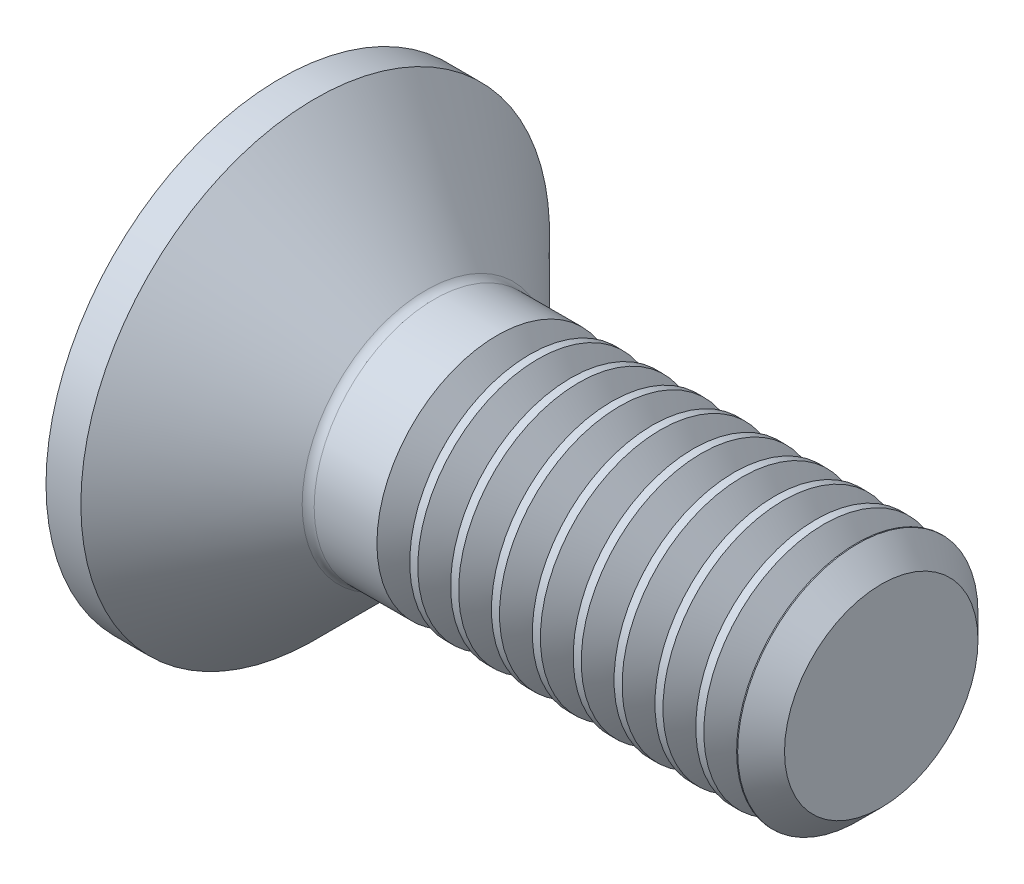
ISO-10303-21;
HEADER;
FILE_DESCRIPTION(('STEP AP214'),'2;1');
FILE_NAME('part.step','',(''),(''),'','','');
FILE_SCHEMA(('AUTOMOTIVE_DESIGN { 1 0 10303 214 1 1 1 1 }'));
ENDSEC;
DATA;
#1=APPLICATION_CONTEXT('core data for automotive mechanical design processes');
#2=APPLICATION_PROTOCOL_DEFINITION('international standard','automotive_design',2000,#1);
#3=PRODUCT_CONTEXT('',#1,'mechanical');
#4=PRODUCT('Part','Part','',(#3));
#5=PRODUCT_RELATED_PRODUCT_CATEGORY('part','',(#4));
#6=PRODUCT_DEFINITION_FORMATION('','',#4);
#7=PRODUCT_DEFINITION_CONTEXT('part definition',#1,'design');
#8=PRODUCT_DEFINITION('design','',#6,#7);
#9=PRODUCT_DEFINITION_SHAPE('','',#8);
#10=(LENGTH_UNIT() NAMED_UNIT(*) SI_UNIT(.MILLI.,.METRE.));
#11=(NAMED_UNIT(*) PLANE_ANGLE_UNIT() SI_UNIT($,.RADIAN.));
#12=(NAMED_UNIT(*) SI_UNIT($,.STERADIAN.) SOLID_ANGLE_UNIT());
#13=UNCERTAINTY_MEASURE_WITH_UNIT(LENGTH_MEASURE(1.E-05),#10,'distance_accuracy_value','');
#14=(GEOMETRIC_REPRESENTATION_CONTEXT(3) GLOBAL_UNCERTAINTY_ASSIGNED_CONTEXT((#13)) GLOBAL_UNIT_ASSIGNED_CONTEXT((#10,
#11,#12)) REPRESENTATION_CONTEXT('',''));
#15=CARTESIAN_POINT('',(0.,0.,0.));
#16=DIRECTION('',(0.,0.,1.));
#17=DIRECTION('',(1.,0.,0.));
#18=AXIS2_PLACEMENT_3D('',#15,#16,#17);
#19=CARTESIAN_POINT('',(6.77236045021345E-12,-4.44089209850063E-13,-4.44089209850063E-13));
#20=DIRECTION('',(-1.,0.,0.));
#21=DIRECTION('',(0.,0.,1.00000000000005));
#22=AXIS2_PLACEMENT_3D('',#19,#20,#21);
#23=PLANE('',#22);
#24=CARTESIAN_POINT('',(6.77236045021345E-12,-4.44089209850063E-13,-4.44089209850063E-13));
#25=DIRECTION('',(-1.,0.,0.));
#26=DIRECTION('',(0.,0.,1.00000000000005));
#27=AXIS2_PLACEMENT_3D('',#24,#25,#26);
#28=CIRCLE('',#27,3.9);
#29=CARTESIAN_POINT('',(6.76196876270296E-12,-3.84986487134142E-13,3.89999999999975));
#30=VERTEX_POINT('',#29);
#31=EDGE_CURVE('E178',#30,#30,#28,.T.);
#32=ORIENTED_EDGE('',*,*,#31,.T.);
#33=EDGE_LOOP('',(#32));
#34=FACE_BOUND('',#33,.T.);
#35=DIRECTION('',(0.,-0.500000000000031,-0.866025403784485));
#36=VECTOR('',#35,1.);
#37=CARTESIAN_POINT('',(6.99440505513849E-12,-0.721687836487961,1.24999999999997));
#38=LINE('',#37,#36);
#39=CARTESIAN_POINT('',(6.99440505513849E-12,-0.721687836487961,1.24999999999997));
#40=VERTEX_POINT('',#39);
#41=CARTESIAN_POINT('',(2.33146835171283E-12,-1.44337567297037,-6.66133814775094E-13));
#42=VERTEX_POINT('',#41);
#43=EDGE_CURVE('E144',#40,#42,#38,.T.);
#44=ORIENTED_EDGE('',*,*,#43,.T.);
#45=DIRECTION('',(0.,0.500000000000004,-0.866025403784473));
#46=VECTOR('',#45,1.);
#47=CARTESIAN_POINT('',(2.33146835171283E-12,-1.44337567297037,-6.66133814775094E-13));
#48=LINE('',#47,#46);
#49=CARTESIAN_POINT('',(2.55351295663786E-12,-0.72168783648463,-1.25000000000197));
#50=VERTEX_POINT('',#49);
#51=EDGE_CURVE('E57',#42,#50,#48,.T.);
#52=ORIENTED_EDGE('',*,*,#51,.T.);
#53=DIRECTION('',(0.,1.00000000000003,0.));
#54=VECTOR('',#53,1.);
#55=CARTESIAN_POINT('',(2.55351295663786E-12,-0.72168783648463,-1.25000000000197));
#56=LINE('',#55,#54);
#57=CARTESIAN_POINT('',(2.77555756156289E-12,0.721687836489071,-1.24999999999909));
#58=VERTEX_POINT('',#57);
#59=EDGE_CURVE('E160',#50,#58,#56,.T.);
#60=ORIENTED_EDGE('',*,*,#59,.T.);
#61=DIRECTION('',(0.,0.500000000000031,0.866025403784486));
#62=VECTOR('',#61,1.);
#63=CARTESIAN_POINT('',(2.77555756156289E-12,0.721687836489071,-1.24999999999909));
#64=LINE('',#63,#62);
#65=CARTESIAN_POINT('',(2.99760216648792E-12,1.44337567297481,0.));
#66=VERTEX_POINT('',#65);
#67=EDGE_CURVE('E691',#58,#66,#64,.T.);
#68=ORIENTED_EDGE('',*,*,#67,.T.);
#69=DIRECTION('',(0.,-0.500000000000002,0.866025403784472));
#70=VECTOR('',#69,1.);
#71=CARTESIAN_POINT('',(2.99760216648792E-12,1.44337567297481,0.));
#72=LINE('',#71,#70);
#73=CARTESIAN_POINT('',(3.66373598126302E-12,0.721687836487961,1.24999999999864));
#74=VERTEX_POINT('',#73);
#75=EDGE_CURVE('E695',#66,#74,#72,.T.);
#76=ORIENTED_EDGE('',*,*,#75,.T.);
#77=DIRECTION('',(0.,-1.00000000000003,0.));
#78=VECTOR('',#77,1.);
#79=CARTESIAN_POINT('',(3.66373598126302E-12,0.721687836487961,1.24999999999864));
#80=LINE('',#79,#78);
#81=EDGE_CURVE('E699',#74,#40,#80,.T.);
#82=ORIENTED_EDGE('',*,*,#81,.T.);
#83=EDGE_LOOP('',(#44,#52,#60,#68,#76,#82));
#84=FACE_BOUND('',#83,.T.);
#85=ADVANCED_FACE('F38',(#34,#84),#23,.T.);
#86=CARTESIAN_POINT('',(6.77236045021345E-12,-4.44089209850063E-13,-4.44089209850063E-13));
#87=DIRECTION('',(-1.,0.,0.));
#88=DIRECTION('',(0.,0.,1.00000000000005));
#89=AXIS2_PLACEMENT_3D('',#86,#87,#88);
#90=CYLINDRICAL_SURFACE('',#89,2.);
#91=CARTESIAN_POINT('',(3.60692006010466,2.22044604925031E-13,4.44089209850063E-13));
#92=DIRECTION('',(-1.,0.,0.));
#93=DIRECTION('',(0.,-1.00000000000003,0.));
#94=AXIS2_PLACEMENT_3D('',#91,#92,#93);
#95=CIRCLE('',#94,2.);
#96=CARTESIAN_POINT('',(3.60692006010465,-1.99999999999984,4.17998968771371E-13));
#97=VERTEX_POINT('',#96);
#98=EDGE_CURVE('E661',#97,#97,#95,.T.);
#99=ORIENTED_EDGE('',*,*,#98,.T.);
#100=EDGE_LOOP('',(#99));
#101=FACE_BOUND('',#100,.T.);
#102=CARTESIAN_POINT('',(2.56284271248142,2.44249065417534E-12,2.22044604925031E-13));
#103=DIRECTION('',(-1.,0.,0.));
#104=DIRECTION('',(0.,0.,1.00000000000005));
#105=AXIS2_PLACEMENT_3D('',#102,#103,#104);
#106=CIRCLE('',#105,2.);
#107=CARTESIAN_POINT('',(2.56284271248141,2.47279974274761E-12,2.00000000000032));
#108=VERTEX_POINT('',#107);
#109=EDGE_CURVE('E11',#108,#108,#106,.F.);
#110=ORIENTED_EDGE('',*,*,#109,.T.);
#111=EDGE_LOOP('',(#110));
#112=FACE_BOUND('',#111,.T.);
#113=ADVANCED_FACE('F214',(#101,#112),#90,.T.);
#114=CARTESIAN_POINT('',(0.580000000006131,-4.44089209850063E-13,-4.44089209850063E-13));
#115=DIRECTION('',(-1.,0.,0.));
#116=DIRECTION('',(0.,0.,1.00000000000005));
#117=AXIS2_PLACEMENT_3D('',#114,#115,#116);
#118=CONICAL_SURFACE('',#117,3.9,0.785398163397451);
#119=CARTESIAN_POINT('',(2.42142135624468,2.44249065417534E-12,2.22044604925031E-13));
#120=DIRECTION('',(-1.,0.,0.));
#121=DIRECTION('',(0.,0.,1.00000000000005));
#122=AXIS2_PLACEMENT_3D('',#119,#120,#121);
#123=CIRCLE('',#122,2.05857864376269);
#124=CARTESIAN_POINT('',(2.42142135624467,2.47368747539873E-12,2.05857864376301));
#125=VERTEX_POINT('',#124);
#126=EDGE_CURVE('E47',#125,#125,#123,.T.);
#127=ORIENTED_EDGE('',*,*,#126,.T.);
#128=EDGE_LOOP('',(#127));
#129=FACE_BOUND('',#128,.T.);
#130=CARTESIAN_POINT('',(0.580000000006131,-4.44089209850063E-13,-4.44089209850063E-13));
#131=DIRECTION('',(-1.,0.,0.));
#132=DIRECTION('',(0.,0.,1.00000000000005));
#133=AXIS2_PLACEMENT_3D('',#130,#131,#132);
#134=CIRCLE('',#133,3.9);
#135=CARTESIAN_POINT('',(0.580000000006121,-3.84986487134142E-13,3.89999999999975));
#136=VERTEX_POINT('',#135);
#137=EDGE_CURVE('E183',#136,#136,#134,.T.);
#138=ORIENTED_EDGE('',*,*,#137,.F.);
#139=EDGE_LOOP('',(#138));
#140=FACE_BOUND('',#139,.T.);
#141=ADVANCED_FACE('F199',(#129,#140),#118,.T.);
#142=CARTESIAN_POINT('',(6.77236045021345E-12,-4.44089209850063E-13,-4.44089209850063E-13));
#143=DIRECTION('',(-1.,0.,0.));
#144=DIRECTION('',(0.,0.,1.00000000000005));
#145=AXIS2_PLACEMENT_3D('',#142,#143,#144);
#146=CYLINDRICAL_SURFACE('',#145,3.9);
#147=ORIENTED_EDGE('',*,*,#137,.T.);
#148=EDGE_LOOP('',(#147));
#149=FACE_BOUND('',#148,.T.);
#150=ORIENTED_EDGE('',*,*,#31,.F.);
#151=EDGE_LOOP('',(#150));
#152=FACE_BOUND('',#151,.T.);
#153=ADVANCED_FACE('F203',(#149,#152),#146,.T.);
#154=CARTESIAN_POINT('',(2.56284271248142,2.44249065417534E-12,2.22044604925031E-13));
#155=DIRECTION('',(-1.,0.,0.));
#156=DIRECTION('',(0.,0.,1.00000000000005));
#157=AXIS2_PLACEMENT_3D('',#154,#155,#156);
#158=TOROIDAL_SURFACE('',#157,2.2,0.2);
#159=ORIENTED_EDGE('',*,*,#109,.F.);
#160=EDGE_LOOP('',(#159));
#161=FACE_BOUND('',#160,.T.);
#162=ORIENTED_EDGE('',*,*,#126,.F.);
#163=EDGE_LOOP('',(#162));
#164=FACE_BOUND('',#163,.T.);
#165=ADVANCED_FACE('F40',(#161,#164),#158,.F.);
#166=CARTESIAN_POINT('',(1.50000000000283,-1.4433756729737,-4.44089209850063E-13));
#167=DIRECTION('',(0.,0.866025403784475,0.500000000000041));
#168=DIRECTION('',(0.,-0.500000000000002,0.866025403784472));
#169=AXIS2_PLACEMENT_3D('',#166,#167,#168);
#170=PLANE('',#169);
#171=ORIENTED_EDGE('',*,*,#51,.F.);
#172=DIRECTION('',(-1.,0.,0.));
#173=VECTOR('',#172,1.);
#174=CARTESIAN_POINT('',(1.50000000000283,-1.4433756729737,-4.44089209850063E-13));
#175=LINE('',#174,#173);
#176=CARTESIAN_POINT('',(1.50000000000283,-1.4433756729737,-4.44089209850063E-13));
#177=VERTEX_POINT('',#176);
#178=EDGE_CURVE('E686',#177,#42,#175,.T.);
#179=ORIENTED_EDGE('',*,*,#178,.F.);
#180=DIRECTION('',(0.,0.500000000000004,-0.866025403784473));
#181=VECTOR('',#180,1.);
#182=CARTESIAN_POINT('',(1.50000000000283,-1.4433756729737,-4.44089209850063E-13));
#183=LINE('',#182,#181);
#184=CARTESIAN_POINT('',(1.50000000000261,-1.08253175472917,-0.624999999998987));
#185=VERTEX_POINT('',#184);
#186=EDGE_CURVE('E140',#177,#185,#183,.T.);
#187=ORIENTED_EDGE('',*,*,#186,.T.);
#188=CARTESIAN_POINT('',(1.50000000000305,-0.721687836483298,-1.25000000000131));
#189=VERTEX_POINT('',#188);
#190=EDGE_CURVE('E134',#185,#189,#183,.T.);
#191=ORIENTED_EDGE('',*,*,#190,.T.);
#192=DIRECTION('',(-1.,0.,0.));
#193=VECTOR('',#192,1.);
#194=CARTESIAN_POINT('',(1.50000000000305,-0.721687836483298,-1.25000000000131));
#195=LINE('',#194,#193);
#196=EDGE_CURVE('E138',#189,#50,#195,.T.);
#197=ORIENTED_EDGE('',*,*,#196,.T.);
#198=EDGE_LOOP('',(#171,#179,#187,#191,#197));
#199=FACE_BOUND('',#198,.T.);
#200=ADVANCED_FACE('F136',(#199),#170,.T.);
#201=CARTESIAN_POINT('',(1.50000000000305,-0.721687836483298,-1.25000000000131));
#202=DIRECTION('',(0.,0.,1.00000000000005));
#203=DIRECTION('',(0.,-1.00000000000003,0.));
#204=AXIS2_PLACEMENT_3D('',#201,#202,#203);
#205=PLANE('',#204);
#206=ORIENTED_EDGE('',*,*,#59,.F.);
#207=ORIENTED_EDGE('',*,*,#196,.F.);
#208=DIRECTION('',(0.,1.00000000000003,0.));
#209=VECTOR('',#208,1.);
#210=CARTESIAN_POINT('',(1.50000000000305,-0.721687836483298,-1.25000000000131));
#211=LINE('',#210,#209);
#212=CARTESIAN_POINT('',(1.50000000000283,3.99680288865056E-12,-1.24999999999797));
#213=VERTEX_POINT('',#212);
#214=EDGE_CURVE('E147',#189,#213,#211,.T.);
#215=ORIENTED_EDGE('',*,*,#214,.T.);
#216=CARTESIAN_POINT('',(1.5000000000035,0.721687836487295,-1.24999999999864));
#217=VERTEX_POINT('',#216);
#218=EDGE_CURVE('E155',#213,#217,#211,.T.);
#219=ORIENTED_EDGE('',*,*,#218,.T.);
#220=DIRECTION('',(-1.,0.,0.));
#221=VECTOR('',#220,1.);
#222=CARTESIAN_POINT('',(1.5000000000035,0.721687836487295,-1.24999999999864));
#223=LINE('',#222,#221);
#224=EDGE_CURVE('E163',#217,#58,#223,.T.);
#225=ORIENTED_EDGE('',*,*,#224,.T.);
#226=EDGE_LOOP('',(#206,#207,#215,#219,#225));
#227=FACE_BOUND('',#226,.T.);
#228=ADVANCED_FACE('F157',(#227),#205,.T.);
#229=CARTESIAN_POINT('',(1.5000000000035,0.721687836487295,-1.24999999999864));
#230=DIRECTION('',(0.,-0.866025403784459,0.500000000000009));
#231=DIRECTION('',(0.,-0.500000000000031,-0.866025403784486));
#232=AXIS2_PLACEMENT_3D('',#229,#230,#231);
#233=PLANE('',#232);
#234=ORIENTED_EDGE('',*,*,#67,.F.);
#235=ORIENTED_EDGE('',*,*,#224,.F.);
#236=DIRECTION('',(0.,0.500000000000031,0.866025403784486));
#237=VECTOR('',#236,1.);
#238=CARTESIAN_POINT('',(1.5000000000035,0.721687836487295,-1.24999999999864));
#239=LINE('',#238,#237);
#240=CARTESIAN_POINT('',(1.50000000000372,1.08253175473205,-0.625000000002318));
#241=VERTEX_POINT('',#240);
#242=EDGE_CURVE('E669',#217,#241,#239,.T.);
#243=ORIENTED_EDGE('',*,*,#242,.T.);
#244=CARTESIAN_POINT('',(1.50000000000239,1.44337567297637,-1.99840144432528E-12));
#245=VERTEX_POINT('',#244);
#246=EDGE_CURVE('E154',#241,#245,#239,.T.);
#247=ORIENTED_EDGE('',*,*,#246,.T.);
#248=DIRECTION('',(-1.,0.,0.));
#249=VECTOR('',#248,1.);
#250=CARTESIAN_POINT('',(1.50000000000239,1.44337567297637,-1.99840144432528E-12));
#251=LINE('',#250,#249);
#252=EDGE_CURVE('E172',#245,#66,#251,.T.);
#253=ORIENTED_EDGE('',*,*,#252,.T.);
#254=EDGE_LOOP('',(#234,#235,#243,#247,#253));
#255=FACE_BOUND('',#254,.T.);
#256=ADVANCED_FACE('F341',(#255),#233,.T.);
#257=CARTESIAN_POINT('',(1.50000000000239,1.44337567297637,-1.99840144432528E-12));
#258=DIRECTION('',(0.,-0.866025403784475,-0.500000000000038));
#259=DIRECTION('',(0.,0.500000000000002,-0.866025403784472));
#260=AXIS2_PLACEMENT_3D('',#257,#258,#259);
#261=PLANE('',#260);
#262=ORIENTED_EDGE('',*,*,#75,.F.);
#263=ORIENTED_EDGE('',*,*,#252,.F.);
#264=DIRECTION('',(0.,-0.500000000000002,0.866025403784472));
#265=VECTOR('',#264,1.);
#266=CARTESIAN_POINT('',(1.50000000000239,1.44337567297637,-1.99840144432528E-12));
#267=LINE('',#266,#265);
#268=CARTESIAN_POINT('',(1.50000000000372,1.08253175472872,0.624999999998765));
#269=VERTEX_POINT('',#268);
#270=EDGE_CURVE('E66',#245,#269,#267,.T.);
#271=ORIENTED_EDGE('',*,*,#270,.T.);
#272=CARTESIAN_POINT('',(1.50000000000305,0.721687836486407,1.24999999999953));
#273=VERTEX_POINT('',#272);
#274=EDGE_CURVE('E673',#269,#273,#267,.T.);
#275=ORIENTED_EDGE('',*,*,#274,.T.);
#276=DIRECTION('',(-1.,0.,0.));
#277=VECTOR('',#276,1.);
#278=CARTESIAN_POINT('',(1.50000000000305,0.721687836486407,1.24999999999953));
#279=LINE('',#278,#277);
#280=EDGE_CURVE('E712',#273,#74,#279,.T.);
#281=ORIENTED_EDGE('',*,*,#280,.T.);
#282=EDGE_LOOP('',(#262,#263,#271,#275,#281));
#283=FACE_BOUND('',#282,.T.);
#284=ADVANCED_FACE('F337',(#283),#261,.T.);
#285=CARTESIAN_POINT('',(1.50000000000305,0.721687836486407,1.24999999999953));
#286=DIRECTION('',(0.,0.,-1.00000000000005));
#287=DIRECTION('',(0.,1.00000000000003,0.));
#288=AXIS2_PLACEMENT_3D('',#285,#286,#287);
#289=PLANE('',#288);
#290=ORIENTED_EDGE('',*,*,#81,.F.);
#291=ORIENTED_EDGE('',*,*,#280,.F.);
#292=DIRECTION('',(0.,-1.00000000000003,0.));
#293=VECTOR('',#292,1.);
#294=CARTESIAN_POINT('',(1.50000000000305,0.721687836486407,1.24999999999953));
#295=LINE('',#294,#293);
#296=CARTESIAN_POINT('',(1.50000000000305,0.,1.25000000000064));
#297=VERTEX_POINT('',#296);
#298=EDGE_CURVE('E677',#273,#297,#295,.T.);
#299=ORIENTED_EDGE('',*,*,#298,.T.);
#300=CARTESIAN_POINT('',(1.50000000000639,-0.721687836485296,1.25000000000153));
#301=VERTEX_POINT('',#300);
#302=EDGE_CURVE('E676',#297,#301,#295,.T.);
#303=ORIENTED_EDGE('',*,*,#302,.T.);
#304=DIRECTION('',(-1.,0.,0.));
#305=VECTOR('',#304,1.);
#306=CARTESIAN_POINT('',(1.50000000000639,-0.721687836485296,1.25000000000153));
#307=LINE('',#306,#305);
#308=EDGE_CURVE('E708',#301,#40,#307,.T.);
#309=ORIENTED_EDGE('',*,*,#308,.T.);
#310=EDGE_LOOP('',(#290,#291,#299,#303,#309));
#311=FACE_BOUND('',#310,.T.);
#312=ADVANCED_FACE('F333',(#311),#289,.T.);
#313=CARTESIAN_POINT('',(1.50000000000639,-0.721687836485296,1.25000000000153));
#314=DIRECTION('',(0.,0.866025403784459,-0.500000000000009));
#315=DIRECTION('',(0.,0.500000000000031,0.866025403784485));
#316=AXIS2_PLACEMENT_3D('',#313,#314,#315);
#317=PLANE('',#316);
#318=ORIENTED_EDGE('',*,*,#43,.F.);
#319=ORIENTED_EDGE('',*,*,#308,.F.);
#320=DIRECTION('',(0.,-0.500000000000031,-0.866025403784485));
#321=VECTOR('',#320,1.);
#322=CARTESIAN_POINT('',(1.50000000000639,-0.721687836485296,1.25000000000153));
#323=LINE('',#322,#321);
#324=CARTESIAN_POINT('',(1.50000000000305,-1.08253175472917,0.625000000002096));
#325=VERTEX_POINT('',#324);
#326=EDGE_CURVE('E682',#301,#325,#323,.T.);
#327=ORIENTED_EDGE('',*,*,#326,.T.);
#328=EDGE_CURVE('E681',#325,#177,#323,.T.);
#329=ORIENTED_EDGE('',*,*,#328,.T.);
#330=ORIENTED_EDGE('',*,*,#178,.T.);
#331=EDGE_LOOP('',(#318,#319,#327,#329,#330));
#332=FACE_BOUND('',#331,.T.);
#333=ADVANCED_FACE('F328',(#332),#317,.T.);
#334=CARTESIAN_POINT('',(1.50000000000283,-1.4433756729737,-4.44089209850063E-13));
#335=DIRECTION('',(-1.,0.,0.));
#336=DIRECTION('',(0.,0.,1.00000000000005));
#337=AXIS2_PLACEMENT_3D('',#334,#335,#336);
#338=PLANE('',#337);
#339=CARTESIAN_POINT('',(1.50000000000594,2.22044604925031E-13,4.44089209850063E-13));
#340=DIRECTION('',(-1.,0.,0.));
#341=DIRECTION('',(0.,0.,1.00000000000005));
#342=AXIS2_PLACEMENT_3D('',#339,#340,#341);
#343=CIRCLE('',#342,1.25);
#344=EDGE_CURVE('E162',#325,#297,#343,.T.);
#345=ORIENTED_EDGE('',*,*,#344,.F.);
#346=ORIENTED_EDGE('',*,*,#326,.F.);
#347=ORIENTED_EDGE('',*,*,#302,.F.);
#348=EDGE_LOOP('',(#345,#346,#347));
#349=FACE_BOUND('',#348,.T.);
#350=ADVANCED_FACE('F324',(#349),#338,.T.);
#351=EDGE_CURVE('E168',#185,#325,#343,.T.);
#352=ORIENTED_EDGE('',*,*,#351,.F.);
#353=ORIENTED_EDGE('',*,*,#186,.F.);
#354=ORIENTED_EDGE('',*,*,#328,.F.);
#355=EDGE_LOOP('',(#352,#353,#354));
#356=FACE_BOUND('',#355,.T.);
#357=ADVANCED_FACE('F327',(#356),#338,.T.);
#358=EDGE_CURVE('E149',#213,#185,#343,.T.);
#359=ORIENTED_EDGE('',*,*,#358,.F.);
#360=ORIENTED_EDGE('',*,*,#214,.F.);
#361=ORIENTED_EDGE('',*,*,#190,.F.);
#362=EDGE_LOOP('',(#359,#360,#361));
#363=FACE_BOUND('',#362,.T.);
#364=ADVANCED_FACE('F148',(#363),#338,.T.);
#365=EDGE_CURVE('E729',#241,#213,#343,.T.);
#366=ORIENTED_EDGE('',*,*,#365,.F.);
#367=ORIENTED_EDGE('',*,*,#242,.F.);
#368=ORIENTED_EDGE('',*,*,#218,.F.);
#369=EDGE_LOOP('',(#366,#367,#368));
#370=FACE_BOUND('',#369,.T.);
#371=ADVANCED_FACE('F382',(#370),#338,.T.);
#372=EDGE_CURVE('E179',#269,#241,#343,.T.);
#373=ORIENTED_EDGE('',*,*,#372,.F.);
#374=ORIENTED_EDGE('',*,*,#270,.F.);
#375=ORIENTED_EDGE('',*,*,#246,.F.);
#376=EDGE_LOOP('',(#373,#374,#375));
#377=FACE_BOUND('',#376,.T.);
#378=ADVANCED_FACE('F388',(#377),#338,.T.);
#379=EDGE_CURVE('E170',#297,#269,#343,.T.);
#380=ORIENTED_EDGE('',*,*,#379,.F.);
#381=ORIENTED_EDGE('',*,*,#298,.F.);
#382=ORIENTED_EDGE('',*,*,#274,.F.);
#383=EDGE_LOOP('',(#380,#381,#382));
#384=FACE_BOUND('',#383,.T.);
#385=ADVANCED_FACE('F330',(#384),#338,.T.);
#386=CARTESIAN_POINT('',(1.50000000000594,2.22044604925031E-13,4.44089209850063E-13));
#387=DIRECTION('',(-1.,0.,0.));
#388=DIRECTION('',(0.,0.,1.00000000000005));
#389=AXIS2_PLACEMENT_3D('',#386,#387,#388);
#390=CONICAL_SURFACE('',#389,1.25,1.04719755119659);
#391=CARTESIAN_POINT('',(2.22168783649368,3.33066907387547E-12,1.11022302462516E-12));
#392=VERTEX_POINT('',#391);
#393=VERTEX_LOOP('',#392);
#394=FACE_BOUND('',#393,.T.);
#395=ORIENTED_EDGE('',*,*,#379,.T.);
#396=ORIENTED_EDGE('',*,*,#372,.T.);
#397=ORIENTED_EDGE('',*,*,#365,.T.);
#398=ORIENTED_EDGE('',*,*,#358,.T.);
#399=ORIENTED_EDGE('',*,*,#351,.T.);
#400=ORIENTED_EDGE('',*,*,#344,.T.);
#401=EDGE_LOOP('',(#395,#396,#397,#398,#399,#400));
#402=FACE_BOUND('',#401,.T.);
#403=ADVANCED_FACE('F226',(#394,#402),#390,.F.);
#404=CARTESIAN_POINT('',(4.15308193990882,1.77635683940025E-12,4.66293670342566E-12));
#405=DIRECTION('',(1.,0.,0.));
#406=DIRECTION('',(0.,1.00000000000003,0.));
#407=AXIS2_PLACEMENT_3D('',#404,#405,#406);
#408=CONICAL_SURFACE('',#407,2.,0.959931088596881);
#409=CARTESIAN_POINT('',(3.88000100000652,2.22044604925031E-13,4.44089209850063E-13));
#410=DIRECTION('',(-1.,0.,0.));
#411=DIRECTION('',(0.,-1.00000000000003,0.));
#412=AXIS2_PLACEMENT_3D('',#409,#410,#411);
#413=CIRCLE('',#412,1.61);
#414=CARTESIAN_POINT('',(3.88000100000651,-1.60999999999983,4.23086565781716E-13));
#415=VERTEX_POINT('',#414);
#416=EDGE_CURVE('E657',#415,#415,#413,.T.);
#417=ORIENTED_EDGE('',*,*,#416,.F.);
#418=EDGE_LOOP('',(#417));
#419=FACE_BOUND('',#418,.T.);
#420=CARTESIAN_POINT('',(4.15308193990882,1.77635683940025E-12,4.66293670342566E-12));
#421=DIRECTION('',(-1.,0.,0.));
#422=DIRECTION('',(0.,-1.00000000000003,0.));
#423=AXIS2_PLACEMENT_3D('',#420,#421,#422);
#424=CIRCLE('',#423,2.);
#425=CARTESIAN_POINT('',(4.15308193990881,-1.99999999999829,4.63684646234697E-12));
#426=VERTEX_POINT('',#425);
#427=EDGE_CURVE('E664',#426,#426,#424,.T.);
#428=ORIENTED_EDGE('',*,*,#427,.T.);
#429=EDGE_LOOP('',(#428));
#430=FACE_BOUND('',#429,.T.);
#431=ADVANCED_FACE('F319',(#419,#430),#408,.T.);
#432=CARTESIAN_POINT('',(3.88000100000652,2.22044604925031E-13,4.44089209850063E-13));
#433=DIRECTION('',(-1.,0.,0.));
#434=DIRECTION('',(0.,-1.00000000000003,0.));
#435=AXIS2_PLACEMENT_3D('',#432,#433,#434);
#436=CONICAL_SURFACE('',#435,1.61,0.959931088596875);
#437=ORIENTED_EDGE('',*,*,#98,.F.);
#438=EDGE_LOOP('',(#437));
#439=FACE_BOUND('',#438,.T.);
#440=ORIENTED_EDGE('',*,*,#416,.T.);
#441=EDGE_LOOP('',(#440));
#442=FACE_BOUND('',#441,.T.);
#443=ADVANCED_FACE('F316',(#439,#442),#436,.T.);
#444=CARTESIAN_POINT('',(4.28692006010467,2.88657986402541E-12,0.));
#445=DIRECTION('',(-1.,0.,0.));
#446=DIRECTION('',(0.,-1.00000000000003,0.));
#447=AXIS2_PLACEMENT_3D('',#444,#445,#446);
#448=CIRCLE('',#447,2.);
#449=CARTESIAN_POINT('',(4.28692006010466,-1.99999999999718,0.));
#450=VERTEX_POINT('',#449);
#451=EDGE_CURVE('E649',#450,#450,#448,.T.);
#452=ORIENTED_EDGE('',*,*,#451,.T.);
#453=EDGE_LOOP('',(#452));
#454=FACE_BOUND('',#453,.T.);
#455=ORIENTED_EDGE('',*,*,#427,.F.);
#456=EDGE_LOOP('',(#455));
#457=FACE_BOUND('',#456,.T.);
#458=ADVANCED_FACE('F223',(#454,#457),#90,.T.);
#459=CARTESIAN_POINT('',(4.83308193990839,2.44249065417534E-12,2.22044604925031E-13));
#460=DIRECTION('',(1.,0.,0.));
#461=DIRECTION('',(0.,1.00000000000003,0.));
#462=AXIS2_PLACEMENT_3D('',#459,#460,#461);
#463=CONICAL_SURFACE('',#462,2.,0.959931088596881);
#464=CARTESIAN_POINT('',(4.56000100000697,2.88657986402541E-12,0.));
#465=DIRECTION('',(-1.,0.,0.));
#466=DIRECTION('',(0.,-1.00000000000003,0.));
#467=AXIS2_PLACEMENT_3D('',#464,#465,#466);
#468=CIRCLE('',#467,1.61);
#469=CARTESIAN_POINT('',(4.56000100000697,-1.60999999999717,0.));
#470=VERTEX_POINT('',#469);
#471=EDGE_CURVE('E645',#470,#470,#468,.T.);
#472=ORIENTED_EDGE('',*,*,#471,.F.);
#473=EDGE_LOOP('',(#472));
#474=FACE_BOUND('',#473,.T.);
#475=CARTESIAN_POINT('',(4.83308193990839,2.44249065417534E-12,2.22044604925031E-13));
#476=DIRECTION('',(-1.,0.,0.));
#477=DIRECTION('',(0.,-1.00000000000003,0.));
#478=AXIS2_PLACEMENT_3D('',#475,#476,#477);
#479=CIRCLE('',#478,2.);
#480=CARTESIAN_POINT('',(4.83308193990838,-1.99999999999762,1.9595436384634E-13));
#481=VERTEX_POINT('',#480);
#482=EDGE_CURVE('E653',#481,#481,#479,.T.);
#483=ORIENTED_EDGE('',*,*,#482,.T.);
#484=EDGE_LOOP('',(#483));
#485=FACE_BOUND('',#484,.T.);
#486=ADVANCED_FACE('F311',(#474,#485),#463,.T.);
#487=CARTESIAN_POINT('',(4.56000100000697,2.88657986402541E-12,0.));
#488=DIRECTION('',(-1.,0.,0.));
#489=DIRECTION('',(0.,-1.00000000000003,0.));
#490=AXIS2_PLACEMENT_3D('',#487,#488,#489);
#491=CONICAL_SURFACE('',#490,1.61,0.959931088596875);
#492=ORIENTED_EDGE('',*,*,#451,.F.);
#493=EDGE_LOOP('',(#492));
#494=FACE_BOUND('',#493,.T.);
#495=ORIENTED_EDGE('',*,*,#471,.T.);
#496=EDGE_LOOP('',(#495));
#497=FACE_BOUND('',#496,.T.);
#498=ADVANCED_FACE('F308',(#494,#497),#491,.T.);
#499=CARTESIAN_POINT('',(4.96692006010424,3.33066907387547E-12,1.11022302462516E-12));
#500=DIRECTION('',(-1.,0.,0.));
#501=DIRECTION('',(0.,-1.00000000000003,0.));
#502=AXIS2_PLACEMENT_3D('',#499,#500,#501);
#503=CIRCLE('',#502,2.);
#504=CARTESIAN_POINT('',(4.96692006010423,-1.99999999999673,1.08413278354647E-12));
#505=VERTEX_POINT('',#504);
#506=EDGE_CURVE('E637',#505,#505,#503,.T.);
#507=ORIENTED_EDGE('',*,*,#506,.T.);
#508=EDGE_LOOP('',(#507));
#509=FACE_BOUND('',#508,.T.);
#510=ORIENTED_EDGE('',*,*,#482,.F.);
#511=EDGE_LOOP('',(#510));
#512=FACE_BOUND('',#511,.T.);
#513=ADVANCED_FACE('F306',(#509,#512),#90,.T.);
#514=CARTESIAN_POINT('',(5.51308193990885,2.88657986402541E-12,0.));
#515=DIRECTION('',(1.,0.,0.));
#516=DIRECTION('',(0.,1.00000000000003,0.));
#517=AXIS2_PLACEMENT_3D('',#514,#515,#516);
#518=CONICAL_SURFACE('',#517,2.,0.959931088596881);
#519=CARTESIAN_POINT('',(5.24000100000699,5.99520433297585E-12,-1.33226762955019E-12));
#520=DIRECTION('',(-1.,0.,0.));
#521=DIRECTION('',(0.,-1.00000000000003,0.));
#522=AXIS2_PLACEMENT_3D('',#519,#520,#521);
#523=CIRCLE('',#522,1.61);
#524=CARTESIAN_POINT('',(5.24000100000698,-1.60999999999406,-1.35327027361853E-12));
#525=VERTEX_POINT('',#524);
#526=EDGE_CURVE('E633',#525,#525,#523,.T.);
#527=ORIENTED_EDGE('',*,*,#526,.F.);
#528=EDGE_LOOP('',(#527));
#529=FACE_BOUND('',#528,.T.);
#530=CARTESIAN_POINT('',(5.51308193990885,2.88657986402541E-12,0.));
#531=DIRECTION('',(-1.,0.,0.));
#532=DIRECTION('',(0.,-1.00000000000003,0.));
#533=AXIS2_PLACEMENT_3D('',#530,#531,#532);
#534=CIRCLE('',#533,2.);
#535=CARTESIAN_POINT('',(5.51308193990884,-1.99999999999718,0.));
#536=VERTEX_POINT('',#535);
#537=EDGE_CURVE('E641',#536,#536,#534,.T.);
#538=ORIENTED_EDGE('',*,*,#537,.T.);
#539=EDGE_LOOP('',(#538));
#540=FACE_BOUND('',#539,.T.);
#541=ADVANCED_FACE('F302',(#529,#540),#518,.T.);
#542=CARTESIAN_POINT('',(5.24000100000699,5.99520433297585E-12,-1.33226762955019E-12));
#543=DIRECTION('',(-1.,0.,0.));
#544=DIRECTION('',(0.,-1.00000000000003,0.));
#545=AXIS2_PLACEMENT_3D('',#542,#543,#544);
#546=CONICAL_SURFACE('',#545,1.61,0.959931088596875);
#547=ORIENTED_EDGE('',*,*,#506,.F.);
#548=EDGE_LOOP('',(#547));
#549=FACE_BOUND('',#548,.T.);
#550=ORIENTED_EDGE('',*,*,#526,.T.);
#551=EDGE_LOOP('',(#550));
#552=FACE_BOUND('',#551,.T.);
#553=ADVANCED_FACE('F299',(#549,#552),#546,.T.);
#554=CARTESIAN_POINT('',(5.6469200601047,3.99680288865056E-12,-1.33226762955019E-12));
#555=DIRECTION('',(-1.,0.,0.));
#556=DIRECTION('',(0.,-1.00000000000003,0.));
#557=AXIS2_PLACEMENT_3D('',#554,#555,#556);
#558=CIRCLE('',#557,2.);
#559=CARTESIAN_POINT('',(5.64692006010469,-1.99999999999607,-1.35835787062888E-12));
#560=VERTEX_POINT('',#559);
#561=EDGE_CURVE('E625',#560,#560,#558,.T.);
#562=ORIENTED_EDGE('',*,*,#561,.T.);
#563=EDGE_LOOP('',(#562));
#564=FACE_BOUND('',#563,.T.);
#565=ORIENTED_EDGE('',*,*,#537,.F.);
#566=EDGE_LOOP('',(#565));
#567=FACE_BOUND('',#566,.T.);
#568=ADVANCED_FACE('F297',(#564,#567),#90,.T.);
#569=CARTESIAN_POINT('',(6.19308193990842,3.99680288865056E-12,-1.33226762955019E-12));
#570=DIRECTION('',(1.,0.,0.));
#571=DIRECTION('',(0.,1.00000000000003,0.));
#572=AXIS2_PLACEMENT_3D('',#569,#570,#571);
#573=CONICAL_SURFACE('',#572,2.,0.959931088596881);
#574=CARTESIAN_POINT('',(5.92000100000656,3.99680288865056E-12,-1.33226762955019E-12));
#575=DIRECTION('',(-1.,0.,0.));
#576=DIRECTION('',(0.,-1.00000000000003,0.));
#577=AXIS2_PLACEMENT_3D('',#574,#575,#576);
#578=CIRCLE('',#577,1.61);
#579=CARTESIAN_POINT('',(5.92000100000655,-1.60999999999606,-1.35327027361853E-12));
#580=VERTEX_POINT('',#579);
#581=EDGE_CURVE('E621',#580,#580,#578,.T.);
#582=ORIENTED_EDGE('',*,*,#581,.F.);
#583=EDGE_LOOP('',(#582));
#584=FACE_BOUND('',#583,.T.);
#585=CARTESIAN_POINT('',(6.19308193990842,3.99680288865056E-12,-1.33226762955019E-12));
#586=DIRECTION('',(-1.,0.,0.));
#587=DIRECTION('',(0.,-1.00000000000003,0.));
#588=AXIS2_PLACEMENT_3D('',#585,#586,#587);
#589=CIRCLE('',#588,2.);
#590=CARTESIAN_POINT('',(6.19308193990841,-1.99999999999607,-1.35835787062888E-12));
#591=VERTEX_POINT('',#590);
#592=EDGE_CURVE('E629',#591,#591,#589,.T.);
#593=ORIENTED_EDGE('',*,*,#592,.T.);
#594=EDGE_LOOP('',(#593));
#595=FACE_BOUND('',#594,.T.);
#596=ADVANCED_FACE('F293',(#584,#595),#573,.T.);
#597=CARTESIAN_POINT('',(5.92000100000656,3.99680288865056E-12,-1.33226762955019E-12));
#598=DIRECTION('',(-1.,0.,0.));
#599=DIRECTION('',(0.,-1.00000000000003,0.));
#600=AXIS2_PLACEMENT_3D('',#597,#598,#599);
#601=CONICAL_SURFACE('',#600,1.61,0.959931088596875);
#602=ORIENTED_EDGE('',*,*,#561,.F.);
#603=EDGE_LOOP('',(#602));
#604=FACE_BOUND('',#603,.T.);
#605=ORIENTED_EDGE('',*,*,#581,.T.);
#606=EDGE_LOOP('',(#605));
#607=FACE_BOUND('',#606,.T.);
#608=ADVANCED_FACE('F290',(#604,#607),#601,.T.);
#609=CARTESIAN_POINT('',(6.32692006010516,4.88498130835069E-12,1.77635683940025E-12));
#610=DIRECTION('',(-1.,0.,0.));
#611=DIRECTION('',(0.,-1.00000000000003,0.));
#612=AXIS2_PLACEMENT_3D('',#609,#610,#611);
#613=CIRCLE('',#612,2.);
#614=CARTESIAN_POINT('',(6.32692006010515,-1.99999999999518,1.75026659832156E-12));
#615=VERTEX_POINT('',#614);
#616=EDGE_CURVE('E613',#615,#615,#613,.T.);
#617=ORIENTED_EDGE('',*,*,#616,.T.);
#618=EDGE_LOOP('',(#617));
#619=FACE_BOUND('',#618,.T.);
#620=ORIENTED_EDGE('',*,*,#592,.F.);
#621=EDGE_LOOP('',(#620));
#622=FACE_BOUND('',#621,.T.);
#623=ADVANCED_FACE('F288',(#619,#622),#90,.T.);
#624=CARTESIAN_POINT('',(6.87308193990843,3.99680288865056E-12,-1.33226762955019E-12));
#625=DIRECTION('',(1.,0.,0.));
#626=DIRECTION('',(0.,1.00000000000003,0.));
#627=AXIS2_PLACEMENT_3D('',#624,#625,#626);
#628=CONICAL_SURFACE('',#627,2.,0.959931088596881);
#629=CARTESIAN_POINT('',(6.60000100000657,5.99520433297585E-12,-1.33226762955019E-12));
#630=DIRECTION('',(-1.,0.,0.));
#631=DIRECTION('',(0.,-1.00000000000003,0.));
#632=AXIS2_PLACEMENT_3D('',#629,#630,#631);
#633=CIRCLE('',#632,1.61);
#634=CARTESIAN_POINT('',(6.60000100000657,-1.60999999999406,-1.35327027361853E-12));
#635=VERTEX_POINT('',#634);
#636=EDGE_CURVE('E609',#635,#635,#633,.T.);
#637=ORIENTED_EDGE('',*,*,#636,.F.);
#638=EDGE_LOOP('',(#637));
#639=FACE_BOUND('',#638,.T.);
#640=CARTESIAN_POINT('',(6.87308193990843,3.99680288865056E-12,-1.33226762955019E-12));
#641=DIRECTION('',(-1.,0.,0.));
#642=DIRECTION('',(0.,-1.00000000000003,0.));
#643=AXIS2_PLACEMENT_3D('',#640,#641,#642);
#644=CIRCLE('',#643,2.);
#645=CARTESIAN_POINT('',(6.87308193990842,-1.99999999999607,-1.35835787062888E-12));
#646=VERTEX_POINT('',#645);
#647=EDGE_CURVE('E617',#646,#646,#644,.T.);
#648=ORIENTED_EDGE('',*,*,#647,.T.);
#649=EDGE_LOOP('',(#648));
#650=FACE_BOUND('',#649,.T.);
#651=ADVANCED_FACE('F284',(#639,#650),#628,.T.);
#652=CARTESIAN_POINT('',(6.60000100000657,5.99520433297585E-12,-1.33226762955019E-12));
#653=DIRECTION('',(-1.,0.,0.));
#654=DIRECTION('',(0.,-1.00000000000003,0.));
#655=AXIS2_PLACEMENT_3D('',#652,#653,#654);
#656=CONICAL_SURFACE('',#655,1.61,0.959931088596875);
#657=ORIENTED_EDGE('',*,*,#616,.F.);
#658=EDGE_LOOP('',(#657));
#659=FACE_BOUND('',#658,.T.);
#660=ORIENTED_EDGE('',*,*,#636,.T.);
#661=EDGE_LOOP('',(#660));
#662=FACE_BOUND('',#661,.T.);
#663=ADVANCED_FACE('F281',(#659,#662),#656,.T.);
#664=CARTESIAN_POINT('',(7.00692006010473,2.88657986402541E-12,0.));
#665=DIRECTION('',(-1.,0.,0.));
#666=DIRECTION('',(0.,-1.00000000000003,0.));
#667=AXIS2_PLACEMENT_3D('',#664,#665,#666);
#668=CIRCLE('',#667,2.);
#669=CARTESIAN_POINT('',(7.00692006010472,-1.99999999999718,0.));
#670=VERTEX_POINT('',#669);
#671=EDGE_CURVE('E601',#670,#670,#668,.T.);
#672=ORIENTED_EDGE('',*,*,#671,.T.);
#673=EDGE_LOOP('',(#672));
#674=FACE_BOUND('',#673,.T.);
#675=ORIENTED_EDGE('',*,*,#647,.F.);
#676=EDGE_LOOP('',(#675));
#677=FACE_BOUND('',#676,.T.);
#678=ADVANCED_FACE('F279',(#674,#677),#90,.T.);
#679=CARTESIAN_POINT('',(7.553081939908,3.99680288865056E-12,-1.33226762955019E-12));
#680=DIRECTION('',(1.,0.,0.));
#681=DIRECTION('',(0.,1.00000000000003,0.));
#682=AXIS2_PLACEMENT_3D('',#679,#680,#681);
#683=CONICAL_SURFACE('',#682,2.,0.959931088596881);
#684=CARTESIAN_POINT('',(7.28000100000659,3.99680288865056E-12,-1.33226762955019E-12));
#685=DIRECTION('',(-1.,0.,0.));
#686=DIRECTION('',(0.,-1.00000000000003,0.));
#687=AXIS2_PLACEMENT_3D('',#684,#685,#686);
#688=CIRCLE('',#687,1.61);
#689=CARTESIAN_POINT('',(7.28000100000658,-1.60999999999606,-1.35327027361853E-12));
#690=VERTEX_POINT('',#689);
#691=EDGE_CURVE('E597',#690,#690,#688,.T.);
#692=ORIENTED_EDGE('',*,*,#691,.F.);
#693=EDGE_LOOP('',(#692));
#694=FACE_BOUND('',#693,.T.);
#695=CARTESIAN_POINT('',(7.553081939908,3.99680288865056E-12,-1.33226762955019E-12));
#696=DIRECTION('',(-1.,0.,0.));
#697=DIRECTION('',(0.,-1.00000000000003,0.));
#698=AXIS2_PLACEMENT_3D('',#695,#696,#697);
#699=CIRCLE('',#698,2.);
#700=CARTESIAN_POINT('',(7.55308193990799,-1.99999999999607,-1.35835787062888E-12));
#701=VERTEX_POINT('',#700);
#702=EDGE_CURVE('E605',#701,#701,#699,.T.);
#703=ORIENTED_EDGE('',*,*,#702,.T.);
#704=EDGE_LOOP('',(#703));
#705=FACE_BOUND('',#704,.T.);
#706=ADVANCED_FACE('F275',(#694,#705),#683,.T.);
#707=CARTESIAN_POINT('',(7.28000100000659,3.99680288865056E-12,-1.33226762955019E-12));
#708=DIRECTION('',(-1.,0.,0.));
#709=DIRECTION('',(0.,-1.00000000000003,0.));
#710=AXIS2_PLACEMENT_3D('',#707,#708,#709);
#711=CONICAL_SURFACE('',#710,1.61,0.959931088596875);
#712=ORIENTED_EDGE('',*,*,#671,.F.);
#713=EDGE_LOOP('',(#712));
#714=FACE_BOUND('',#713,.T.);
#715=ORIENTED_EDGE('',*,*,#691,.T.);
#716=EDGE_LOOP('',(#715));
#717=FACE_BOUND('',#716,.T.);
#718=ADVANCED_FACE('F272',(#714,#717),#711,.T.);
#719=CARTESIAN_POINT('',(7.6869200601043,2.88657986402541E-12,0.));
#720=DIRECTION('',(-1.,0.,0.));
#721=DIRECTION('',(0.,-1.00000000000003,0.));
#722=AXIS2_PLACEMENT_3D('',#719,#720,#721);
#723=CIRCLE('',#722,2.);
#724=CARTESIAN_POINT('',(7.68692006010429,-1.99999999999718,0.));
#725=VERTEX_POINT('',#724);
#726=EDGE_CURVE('E589',#725,#725,#723,.T.);
#727=ORIENTED_EDGE('',*,*,#726,.T.);
#728=EDGE_LOOP('',(#727));
#729=FACE_BOUND('',#728,.T.);
#730=ORIENTED_EDGE('',*,*,#702,.F.);
#731=EDGE_LOOP('',(#730));
#732=FACE_BOUND('',#731,.T.);
#733=ADVANCED_FACE('F270',(#729,#732),#90,.T.);
#734=CARTESIAN_POINT('',(8.23308193990757,8.88178419700125E-12,3.5527136788005E-12));
#735=DIRECTION('',(1.,0.,0.));
#736=DIRECTION('',(0.,1.00000000000003,0.));
#737=AXIS2_PLACEMENT_3D('',#734,#735,#736);
#738=CONICAL_SURFACE('',#737,2.,0.959931088596881);
#739=CARTESIAN_POINT('',(7.96000100000571,4.44089209850063E-12,2.22044604925031E-12));
#740=DIRECTION('',(-1.,0.,0.));
#741=DIRECTION('',(0.,-1.00000000000003,0.));
#742=AXIS2_PLACEMENT_3D('',#739,#740,#741);
#743=CIRCLE('',#742,1.61);
#744=CARTESIAN_POINT('',(7.9600010000057,-1.60999999999561,2.19944340518197E-12));
#745=VERTEX_POINT('',#744);
#746=EDGE_CURVE('E585',#745,#745,#743,.T.);
#747=ORIENTED_EDGE('',*,*,#746,.F.);
#748=EDGE_LOOP('',(#747));
#749=FACE_BOUND('',#748,.T.);
#750=CARTESIAN_POINT('',(8.23308193990757,8.88178419700125E-12,3.5527136788005E-12));
#751=DIRECTION('',(-1.,0.,0.));
#752=DIRECTION('',(0.,-1.00000000000003,0.));
#753=AXIS2_PLACEMENT_3D('',#750,#751,#752);
#754=CIRCLE('',#753,2.);
#755=CARTESIAN_POINT('',(8.23308193990756,-1.99999999999118,3.52662343772181E-12));
#756=VERTEX_POINT('',#755);
#757=EDGE_CURVE('E593',#756,#756,#754,.T.);
#758=ORIENTED_EDGE('',*,*,#757,.T.);
#759=EDGE_LOOP('',(#758));
#760=FACE_BOUND('',#759,.T.);
#761=ADVANCED_FACE('F266',(#749,#760),#738,.T.);
#762=CARTESIAN_POINT('',(7.96000100000571,4.44089209850063E-12,2.22044604925031E-12));
#763=DIRECTION('',(-1.,0.,0.));
#764=DIRECTION('',(0.,-1.00000000000003,0.));
#765=AXIS2_PLACEMENT_3D('',#762,#763,#764);
#766=CONICAL_SURFACE('',#765,1.61,0.959931088596875);
#767=ORIENTED_EDGE('',*,*,#726,.F.);
#768=EDGE_LOOP('',(#767));
#769=FACE_BOUND('',#768,.T.);
#770=ORIENTED_EDGE('',*,*,#746,.T.);
#771=EDGE_LOOP('',(#770));
#772=FACE_BOUND('',#771,.T.);
#773=ADVANCED_FACE('F263',(#769,#772),#766,.T.);
#774=CARTESIAN_POINT('',(8.36692006010431,4.44089209850063E-12,2.22044604925031E-12));
#775=DIRECTION('',(-1.,0.,0.));
#776=DIRECTION('',(0.,-1.00000000000003,0.));
#777=AXIS2_PLACEMENT_3D('',#774,#775,#776);
#778=CIRCLE('',#777,2.);
#779=CARTESIAN_POINT('',(8.3669200601043,-1.99999999999562,2.19435580817162E-12));
#780=VERTEX_POINT('',#779);
#781=EDGE_CURVE('E570',#780,#780,#778,.T.);
#782=ORIENTED_EDGE('',*,*,#781,.T.);
#783=EDGE_LOOP('',(#782));
#784=FACE_BOUND('',#783,.T.);
#785=ORIENTED_EDGE('',*,*,#757,.F.);
#786=EDGE_LOOP('',(#785));
#787=FACE_BOUND('',#786,.T.);
#788=ADVANCED_FACE('F261',(#784,#787),#90,.T.);
#789=CARTESIAN_POINT('',(8.91308193990714,4.44089209850063E-12,2.22044604925031E-12));
#790=DIRECTION('',(1.,0.,0.));
#791=DIRECTION('',(0.,1.00000000000003,0.));
#792=AXIS2_PLACEMENT_3D('',#789,#790,#791);
#793=CONICAL_SURFACE('',#792,2.,0.959931088596881);
#794=CARTESIAN_POINT('',(8.64000100000661,4.44089209850063E-12,2.22044604925031E-12));
#795=DIRECTION('',(-1.,0.,0.));
#796=DIRECTION('',(0.,-1.00000000000003,0.));
#797=AXIS2_PLACEMENT_3D('',#794,#795,#796);
#798=CIRCLE('',#797,1.61);
#799=CARTESIAN_POINT('',(8.64000100000661,-1.60999999999561,2.19944340518197E-12));
#800=VERTEX_POINT('',#799);
#801=EDGE_CURVE('E564',#800,#800,#798,.T.);
#802=ORIENTED_EDGE('',*,*,#801,.F.);
#803=EDGE_LOOP('',(#802));
#804=FACE_BOUND('',#803,.T.);
#805=CARTESIAN_POINT('',(8.91308193990714,4.44089209850063E-12,2.22044604925031E-12));
#806=DIRECTION('',(-1.,0.,0.));
#807=DIRECTION('',(0.,-1.00000000000003,0.));
#808=AXIS2_PLACEMENT_3D('',#805,#806,#807);
#809=CIRCLE('',#808,2.);
#810=CARTESIAN_POINT('',(8.91308193990713,-1.99999999999562,2.19435580817162E-12));
#811=VERTEX_POINT('',#810);
#812=EDGE_CURVE('E581',#811,#811,#809,.T.);
#813=ORIENTED_EDGE('',*,*,#812,.T.);
#814=EDGE_LOOP('',(#813));
#815=FACE_BOUND('',#814,.T.);
#816=ADVANCED_FACE('F257',(#804,#815),#793,.T.);
#817=CARTESIAN_POINT('',(8.64000100000661,4.44089209850063E-12,2.22044604925031E-12));
#818=DIRECTION('',(-1.,0.,0.));
#819=DIRECTION('',(0.,-1.00000000000003,0.));
#820=AXIS2_PLACEMENT_3D('',#817,#818,#819);
#821=CONICAL_SURFACE('',#820,1.61,0.959931088596875);
#822=ORIENTED_EDGE('',*,*,#781,.F.);
#823=EDGE_LOOP('',(#822));
#824=FACE_BOUND('',#823,.T.);
#825=ORIENTED_EDGE('',*,*,#801,.T.);
#826=EDGE_LOOP('',(#825));
#827=FACE_BOUND('',#826,.T.);
#828=ADVANCED_FACE('F254',(#824,#827),#821,.T.);
#829=CARTESIAN_POINT('',(9.04692006010432,5.10702591327572E-12,4.44089209850063E-12));
#830=DIRECTION('',(-1.,0.,0.));
#831=DIRECTION('',(0.,-1.00000000000003,0.));
#832=AXIS2_PLACEMENT_3D('',#829,#830,#831);
#833=CIRCLE('',#832,2.);
#834=CARTESIAN_POINT('',(9.04692006010432,-1.99999999999496,4.41480185742193E-12));
#835=VERTEX_POINT('',#834);
#836=EDGE_CURVE('E565',#835,#835,#833,.T.);
#837=ORIENTED_EDGE('',*,*,#836,.T.);
#838=EDGE_LOOP('',(#837));
#839=FACE_BOUND('',#838,.T.);
#840=ORIENTED_EDGE('',*,*,#812,.F.);
#841=EDGE_LOOP('',(#840));
#842=FACE_BOUND('',#841,.T.);
#843=ADVANCED_FACE('F248',(#839,#842),#90,.T.);
#844=CARTESIAN_POINT('',(9.59308193990715,5.10702591327572E-12,4.44089209850063E-12));
#845=DIRECTION('',(1.,0.,0.));
#846=DIRECTION('',(0.,1.00000000000003,0.));
#847=AXIS2_PLACEMENT_3D('',#844,#845,#846);
#848=CONICAL_SURFACE('',#847,2.,0.959931088596881);
#849=CARTESIAN_POINT('',(9.32000100000618,7.7715611723761E-12,2.44249065417534E-12));
#850=DIRECTION('',(-1.,0.,0.));
#851=DIRECTION('',(0.,-1.00000000000003,0.));
#852=AXIS2_PLACEMENT_3D('',#849,#850,#851);
#853=CIRCLE('',#852,1.61);
#854=CARTESIAN_POINT('',(9.32000100000618,-1.60999999999228,2.421488010107E-12));
#855=VERTEX_POINT('',#854);
#856=EDGE_CURVE('E574',#855,#855,#853,.T.);
#857=ORIENTED_EDGE('',*,*,#856,.F.);
#858=EDGE_LOOP('',(#857));
#859=FACE_BOUND('',#858,.T.);
#860=CARTESIAN_POINT('',(9.59308193990715,5.10702591327572E-12,4.44089209850063E-12));
#861=DIRECTION('',(-1.,0.,0.));
#862=DIRECTION('',(0.,-1.00000000000003,0.));
#863=AXIS2_PLACEMENT_3D('',#860,#861,#862);
#864=CIRCLE('',#863,2.);
#865=CARTESIAN_POINT('',(9.59308193990715,-1.99999999999496,4.41480185742193E-12));
#866=VERTEX_POINT('',#865);
#867=EDGE_CURVE('E560',#866,#866,#864,.T.);
#868=ORIENTED_EDGE('',*,*,#867,.T.);
#869=EDGE_LOOP('',(#868));
#870=FACE_BOUND('',#869,.T.);
#871=ADVANCED_FACE('F240',(#859,#870),#848,.T.);
#872=CARTESIAN_POINT('',(9.32000100000618,7.7715611723761E-12,2.44249065417534E-12));
#873=DIRECTION('',(-1.,0.,0.));
#874=DIRECTION('',(0.,-1.00000000000003,0.));
#875=AXIS2_PLACEMENT_3D('',#872,#873,#874);
#876=CONICAL_SURFACE('',#875,1.61,0.959931088596875);
#877=ORIENTED_EDGE('',*,*,#836,.F.);
#878=EDGE_LOOP('',(#877));
#879=FACE_BOUND('',#878,.T.);
#880=ORIENTED_EDGE('',*,*,#856,.T.);
#881=EDGE_LOOP('',(#880));
#882=FACE_BOUND('',#881,.T.);
#883=ADVANCED_FACE('F235',(#879,#882),#876,.T.);
#884=CARTESIAN_POINT('',(10.0000000000032,1.61000000001077,4.88498130835069E-12));
#885=DIRECTION('',(1.,0.,0.));
#886=DIRECTION('',(0.,0.,-1.00000000000005));
#887=AXIS2_PLACEMENT_3D('',#884,#885,#886);
#888=PLANE('',#887);
#889=CARTESIAN_POINT('',(10.0000000000057,8.88178419700125E-12,3.5527136788005E-12));
#890=DIRECTION('',(-1.,0.,0.));
#891=DIRECTION('',(0.,0.,1.00000000000005));
#892=AXIS2_PLACEMENT_3D('',#889,#890,#891);
#893=CIRCLE('',#892,1.61);
#894=CARTESIAN_POINT('',(10.0000000000057,8.90618301330193E-12,1.61000000000363));
#895=VERTEX_POINT('',#894);
#896=EDGE_CURVE('E191',#895,#895,#893,.T.);
#897=ORIENTED_EDGE('',*,*,#896,.F.);
#898=EDGE_LOOP('',(#897));
#899=FACE_BOUND('',#898,.T.);
#900=ADVANCED_FACE('F232',(#899),#888,.T.);
#901=CARTESIAN_POINT('',(10.0000000000057,8.88178419700125E-12,3.5527136788005E-12));
#902=DIRECTION('',(-1.,0.,0.));
#903=DIRECTION('',(0.,0.,1.00000000000005));
#904=AXIS2_PLACEMENT_3D('',#901,#902,#903);
#905=CONICAL_SURFACE('',#904,1.61,0.785398163397444);
#906=CARTESIAN_POINT('',(9.61000000000622,4.44089209850063E-12,2.22044604925031E-12));
#907=DIRECTION('',(-1.,0.,0.));
#908=DIRECTION('',(0.,0.,1.00000000000005));
#909=AXIS2_PLACEMENT_3D('',#906,#907,#908);
#910=CIRCLE('',#909,2.);
#911=CARTESIAN_POINT('',(9.61000000000622,4.47120118707289E-12,2.00000000000232));
#912=VERTEX_POINT('',#911);
#913=EDGE_CURVE('E187',#912,#912,#910,.T.);
#914=ORIENTED_EDGE('',*,*,#913,.F.);
#915=EDGE_LOOP('',(#914));
#916=FACE_BOUND('',#915,.T.);
#917=ORIENTED_EDGE('',*,*,#896,.T.);
#918=EDGE_LOOP('',(#917));
#919=FACE_BOUND('',#918,.T.);
#920=ADVANCED_FACE('F230',(#916,#919),#905,.T.);
#921=ORIENTED_EDGE('',*,*,#867,.F.);
#922=EDGE_LOOP('',(#921));
#923=FACE_BOUND('',#922,.T.);
#924=ORIENTED_EDGE('',*,*,#913,.T.);
#925=EDGE_LOOP('',(#924));
#926=FACE_BOUND('',#925,.T.);
#927=ADVANCED_FACE('F222',(#923,#926),#90,.T.);
#928=CLOSED_SHELL('',(#85,#113,#141,#153,#165,#200,#228,#256,#284,#312,#333,#350,#357,#364,#371,
#378,#385,#403,#431,#443,#458,#486,#498,#513,#541,#553,#568,#596,#608,#623,#651,#663,#678,#706,
#718,#733,#761,#773,#788,#816,#828,#843,#871,#883,#900,#920,#927));
#929=MANIFOLD_SOLID_BREP('B2',#928);
#930=ADVANCED_BREP_SHAPE_REPRESENTATION('',(#18,#929),#14);
#931=SHAPE_DEFINITION_REPRESENTATION(#9,#930);
ENDSEC;
END-ISO-10303-21;
